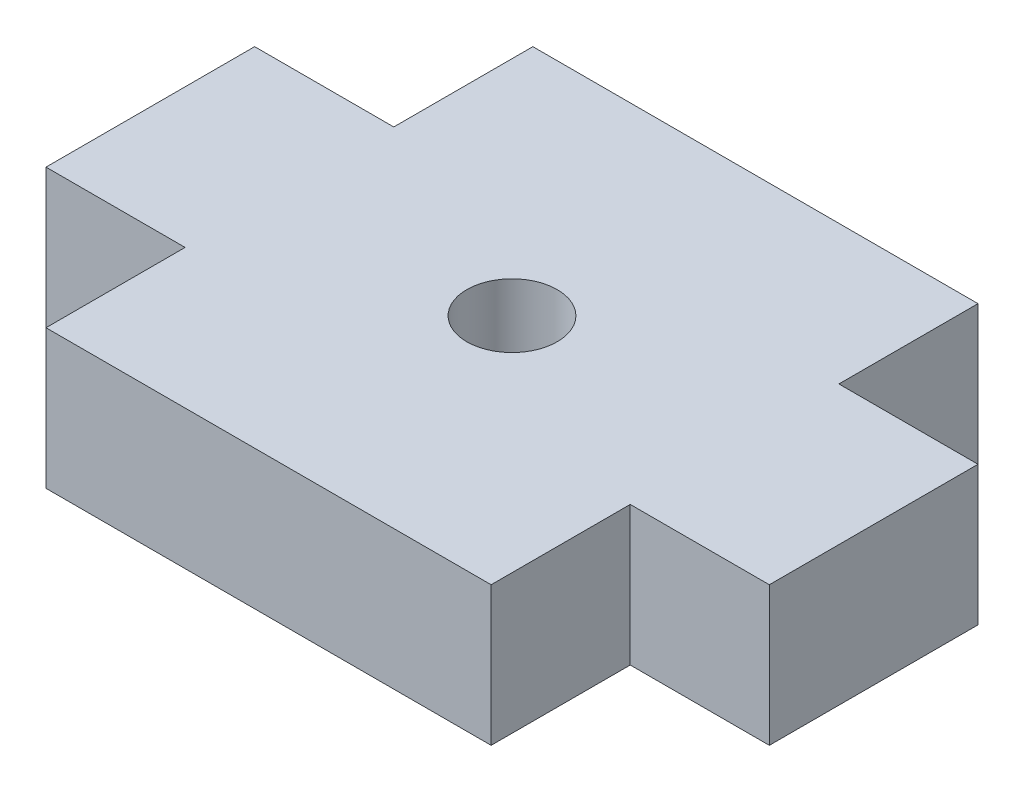
ISO-10303-21;
HEADER;
FILE_DESCRIPTION(('STEP AP214'),'2;1');
FILE_NAME('part.step','',(''),(''),'','','');
FILE_SCHEMA(('AUTOMOTIVE_DESIGN { 1 0 10303 214 1 1 1 1 }'));
ENDSEC;
DATA;
#1=APPLICATION_CONTEXT('core data for automotive mechanical design processes');
#2=APPLICATION_PROTOCOL_DEFINITION('international standard','automotive_design',2000,#1);
#3=PRODUCT_CONTEXT('',#1,'mechanical');
#4=PRODUCT('Part','Part','',(#3));
#5=PRODUCT_RELATED_PRODUCT_CATEGORY('part','',(#4));
#6=PRODUCT_DEFINITION_FORMATION('','',#4);
#7=PRODUCT_DEFINITION_CONTEXT('part definition',#1,'design');
#8=PRODUCT_DEFINITION('design','',#6,#7);
#9=PRODUCT_DEFINITION_SHAPE('','',#8);
#10=(LENGTH_UNIT() NAMED_UNIT(*) SI_UNIT(.MILLI.,.METRE.));
#11=(NAMED_UNIT(*) PLANE_ANGLE_UNIT() SI_UNIT($,.RADIAN.));
#12=(NAMED_UNIT(*) SI_UNIT($,.STERADIAN.) SOLID_ANGLE_UNIT());
#13=UNCERTAINTY_MEASURE_WITH_UNIT(LENGTH_MEASURE(1.E-05),#10,'distance_accuracy_value','');
#14=(GEOMETRIC_REPRESENTATION_CONTEXT(3) GLOBAL_UNCERTAINTY_ASSIGNED_CONTEXT((#13)) GLOBAL_UNIT_ASSIGNED_CONTEXT((#10,
#11,#12)) REPRESENTATION_CONTEXT('',''));
#15=CARTESIAN_POINT('',(0.,0.,0.));
#16=DIRECTION('',(0.,0.,1.));
#17=DIRECTION('',(1.,0.,0.));
#18=AXIS2_PLACEMENT_3D('',#15,#16,#17);
#19=CARTESIAN_POINT('',(8.,5.,-3.75));
#20=DIRECTION('',(0.,1.,0.));
#21=DIRECTION('',(0.,0.,1.));
#22=AXIS2_PLACEMENT_3D('',#19,#20,#21);
#23=PLANE('',#22);
#24=DIRECTION('',(0.,0.,-1.));
#25=VECTOR('',#24,1.);
#26=CARTESIAN_POINT('',(8.,5.,-8.75));
#27=LINE('',#26,#25);
#28=CARTESIAN_POINT('',(8.,5.,-3.75));
#29=VERTEX_POINT('',#28);
#30=CARTESIAN_POINT('',(8.,5.,-8.75));
#31=VERTEX_POINT('',#30);
#32=EDGE_CURVE('E174',#29,#31,#27,.T.);
#33=ORIENTED_EDGE('',*,*,#32,.T.);
#34=DIRECTION('',(-1.,0.,0.));
#35=VECTOR('',#34,1.);
#36=CARTESIAN_POINT('',(-8.,5.,-8.75));
#37=LINE('',#36,#35);
#38=CARTESIAN_POINT('',(-8.,5.,-8.75));
#39=VERTEX_POINT('',#38);
#40=EDGE_CURVE('E102',#31,#39,#37,.T.);
#41=ORIENTED_EDGE('',*,*,#40,.T.);
#42=DIRECTION('',(0.,0.,1.));
#43=VECTOR('',#42,1.);
#44=CARTESIAN_POINT('',(-8.,5.,-8.75));
#45=LINE('',#44,#43);
#46=CARTESIAN_POINT('',(-8.,5.,-3.75));
#47=VERTEX_POINT('',#46);
#48=EDGE_CURVE('E201',#39,#47,#45,.T.);
#49=ORIENTED_EDGE('',*,*,#48,.T.);
#50=DIRECTION('',(-1.,0.,0.));
#51=VECTOR('',#50,1.);
#52=CARTESIAN_POINT('',(-8.,5.,-3.75));
#53=LINE('',#52,#51);
#54=CARTESIAN_POINT('',(-13.,5.,-3.75));
#55=VERTEX_POINT('',#54);
#56=EDGE_CURVE('E220',#47,#55,#53,.T.);
#57=ORIENTED_EDGE('',*,*,#56,.T.);
#58=DIRECTION('',(0.,0.,1.));
#59=VECTOR('',#58,1.);
#60=CARTESIAN_POINT('',(-13.,5.,-3.75));
#61=LINE('',#60,#59);
#62=CARTESIAN_POINT('',(-13.,5.,3.75));
#63=VERTEX_POINT('',#62);
#64=EDGE_CURVE('E217',#55,#63,#61,.T.);
#65=ORIENTED_EDGE('',*,*,#64,.T.);
#66=DIRECTION('',(1.,0.,0.));
#67=VECTOR('',#66,1.);
#68=CARTESIAN_POINT('',(-8.,5.,3.75));
#69=LINE('',#68,#67);
#70=CARTESIAN_POINT('',(-8.,5.,3.75));
#71=VERTEX_POINT('',#70);
#72=EDGE_CURVE('E219',#63,#71,#69,.T.);
#73=ORIENTED_EDGE('',*,*,#72,.T.);
#74=DIRECTION('',(0.,0.,1.));
#75=VECTOR('',#74,1.);
#76=CARTESIAN_POINT('',(-8.,5.,8.75));
#77=LINE('',#76,#75);
#78=CARTESIAN_POINT('',(-8.,5.,8.75));
#79=VERTEX_POINT('',#78);
#80=EDGE_CURVE('E222',#71,#79,#77,.T.);
#81=ORIENTED_EDGE('',*,*,#80,.T.);
#82=DIRECTION('',(1.,0.,0.));
#83=VECTOR('',#82,1.);
#84=CARTESIAN_POINT('',(-8.,5.,8.75));
#85=LINE('',#84,#83);
#86=CARTESIAN_POINT('',(8.,5.,8.75));
#87=VERTEX_POINT('',#86);
#88=EDGE_CURVE('E228',#79,#87,#85,.T.);
#89=ORIENTED_EDGE('',*,*,#88,.T.);
#90=DIRECTION('',(0.,0.,-1.));
#91=VECTOR('',#90,1.);
#92=CARTESIAN_POINT('',(8.,5.,8.75));
#93=LINE('',#92,#91);
#94=CARTESIAN_POINT('',(8.,5.,3.75));
#95=VERTEX_POINT('',#94);
#96=EDGE_CURVE('E133',#87,#95,#93,.T.);
#97=ORIENTED_EDGE('',*,*,#96,.T.);
#98=DIRECTION('',(1.,0.,0.));
#99=VECTOR('',#98,1.);
#100=CARTESIAN_POINT('',(8.,5.,3.75));
#101=LINE('',#100,#99);
#102=CARTESIAN_POINT('',(13.,5.,3.75));
#103=VERTEX_POINT('',#102);
#104=EDGE_CURVE('E127',#95,#103,#101,.T.);
#105=ORIENTED_EDGE('',*,*,#104,.T.);
#106=DIRECTION('',(0.,0.,-1.));
#107=VECTOR('',#106,1.);
#108=CARTESIAN_POINT('',(13.,5.,-3.75));
#109=LINE('',#108,#107);
#110=CARTESIAN_POINT('',(13.,5.,-3.75));
#111=VERTEX_POINT('',#110);
#112=EDGE_CURVE('E131',#103,#111,#109,.T.);
#113=ORIENTED_EDGE('',*,*,#112,.T.);
#114=DIRECTION('',(-1.,0.,0.));
#115=VECTOR('',#114,1.);
#116=CARTESIAN_POINT('',(8.,5.,-3.75));
#117=LINE('',#116,#115);
#118=EDGE_CURVE('E47',#111,#29,#117,.T.);
#119=ORIENTED_EDGE('',*,*,#118,.T.);
#120=EDGE_LOOP('',(#33,#41,#49,#57,#65,#73,#81,#89,#97,#105,#113,#119));
#121=FACE_BOUND('',#120,.T.);
#122=CARTESIAN_POINT('',(0.,5.,0.));
#123=DIRECTION('',(0.,1.,0.));
#124=DIRECTION('',(0.,0.,1.));
#125=AXIS2_PLACEMENT_3D('',#122,#123,#124);
#126=CIRCLE('',#125,1.625);
#127=CARTESIAN_POINT('',(0.,5.,1.625));
#128=VERTEX_POINT('',#127);
#129=EDGE_CURVE('E155',#128,#128,#126,.T.);
#130=ORIENTED_EDGE('',*,*,#129,.F.);
#131=EDGE_LOOP('',(#130));
#132=FACE_BOUND('',#131,.T.);
#133=ADVANCED_FACE('F30',(#121,#132),#23,.T.);
#134=CARTESIAN_POINT('',(8.,0.,-3.75));
#135=DIRECTION('',(0.,1.,0.));
#136=DIRECTION('',(0.,0.,1.));
#137=AXIS2_PLACEMENT_3D('',#134,#135,#136);
#138=PLANE('',#137);
#139=DIRECTION('',(0.,0.,-1.));
#140=VECTOR('',#139,1.);
#141=CARTESIAN_POINT('',(8.,0.,-8.75));
#142=LINE('',#141,#140);
#143=CARTESIAN_POINT('',(8.,0.,-3.75));
#144=VERTEX_POINT('',#143);
#145=CARTESIAN_POINT('',(8.,0.,-8.75));
#146=VERTEX_POINT('',#145);
#147=EDGE_CURVE('E151',#144,#146,#142,.T.);
#148=ORIENTED_EDGE('',*,*,#147,.F.);
#149=DIRECTION('',(-1.,0.,0.));
#150=VECTOR('',#149,1.);
#151=CARTESIAN_POINT('',(8.,0.,-3.75));
#152=LINE('',#151,#150);
#153=CARTESIAN_POINT('',(13.,0.,-3.75));
#154=VERTEX_POINT('',#153);
#155=EDGE_CURVE('E94',#154,#144,#152,.T.);
#156=ORIENTED_EDGE('',*,*,#155,.F.);
#157=DIRECTION('',(0.,0.,-1.));
#158=VECTOR('',#157,1.);
#159=CARTESIAN_POINT('',(13.,0.,-3.75));
#160=LINE('',#159,#158);
#161=CARTESIAN_POINT('',(13.,0.,3.75));
#162=VERTEX_POINT('',#161);
#163=EDGE_CURVE('E88',#162,#154,#160,.T.);
#164=ORIENTED_EDGE('',*,*,#163,.F.);
#165=DIRECTION('',(1.,0.,0.));
#166=VECTOR('',#165,1.);
#167=CARTESIAN_POINT('',(8.,0.,3.75));
#168=LINE('',#167,#166);
#169=CARTESIAN_POINT('',(8.,0.,3.75));
#170=VERTEX_POINT('',#169);
#171=EDGE_CURVE('E141',#170,#162,#168,.T.);
#172=ORIENTED_EDGE('',*,*,#171,.F.);
#173=DIRECTION('',(0.,0.,-1.));
#174=VECTOR('',#173,1.);
#175=CARTESIAN_POINT('',(8.,0.,8.75));
#176=LINE('',#175,#174);
#177=CARTESIAN_POINT('',(8.,0.,8.75));
#178=VERTEX_POINT('',#177);
#179=EDGE_CURVE('E169',#178,#170,#176,.T.);
#180=ORIENTED_EDGE('',*,*,#179,.F.);
#181=DIRECTION('',(1.,0.,0.));
#182=VECTOR('',#181,1.);
#183=CARTESIAN_POINT('',(-8.,0.,8.75));
#184=LINE('',#183,#182);
#185=CARTESIAN_POINT('',(-8.,0.,8.75));
#186=VERTEX_POINT('',#185);
#187=EDGE_CURVE('E167',#186,#178,#184,.T.);
#188=ORIENTED_EDGE('',*,*,#187,.F.);
#189=DIRECTION('',(0.,0.,1.));
#190=VECTOR('',#189,1.);
#191=CARTESIAN_POINT('',(-8.,0.,8.75));
#192=LINE('',#191,#190);
#193=CARTESIAN_POINT('',(-8.,0.,3.75));
#194=VERTEX_POINT('',#193);
#195=EDGE_CURVE('E165',#194,#186,#192,.T.);
#196=ORIENTED_EDGE('',*,*,#195,.F.);
#197=DIRECTION('',(1.,0.,0.));
#198=VECTOR('',#197,1.);
#199=CARTESIAN_POINT('',(-8.,0.,3.75));
#200=LINE('',#199,#198);
#201=CARTESIAN_POINT('',(-13.,0.,3.75));
#202=VERTEX_POINT('',#201);
#203=EDGE_CURVE('E163',#202,#194,#200,.T.);
#204=ORIENTED_EDGE('',*,*,#203,.F.);
#205=DIRECTION('',(0.,0.,1.));
#206=VECTOR('',#205,1.);
#207=CARTESIAN_POINT('',(-13.,0.,-3.75));
#208=LINE('',#207,#206);
#209=CARTESIAN_POINT('',(-13.,0.,-3.75));
#210=VERTEX_POINT('',#209);
#211=EDGE_CURVE('E161',#210,#202,#208,.T.);
#212=ORIENTED_EDGE('',*,*,#211,.F.);
#213=DIRECTION('',(-1.,0.,0.));
#214=VECTOR('',#213,1.);
#215=CARTESIAN_POINT('',(-8.,0.,-3.75));
#216=LINE('',#215,#214);
#217=CARTESIAN_POINT('',(-8.,0.,-3.75));
#218=VERTEX_POINT('',#217);
#219=EDGE_CURVE('E159',#218,#210,#216,.T.);
#220=ORIENTED_EDGE('',*,*,#219,.F.);
#221=DIRECTION('',(0.,0.,1.));
#222=VECTOR('',#221,1.);
#223=CARTESIAN_POINT('',(-8.,0.,-8.75));
#224=LINE('',#223,#222);
#225=CARTESIAN_POINT('',(-8.,0.,-8.75));
#226=VERTEX_POINT('',#225);
#227=EDGE_CURVE('E157',#226,#218,#224,.T.);
#228=ORIENTED_EDGE('',*,*,#227,.F.);
#229=DIRECTION('',(-1.,0.,0.));
#230=VECTOR('',#229,1.);
#231=CARTESIAN_POINT('',(-8.,0.,-8.75));
#232=LINE('',#231,#230);
#233=EDGE_CURVE('E154',#146,#226,#232,.T.);
#234=ORIENTED_EDGE('',*,*,#233,.F.);
#235=EDGE_LOOP('',(#148,#156,#164,#172,#180,#188,#196,#204,#212,#220,#228,#234));
#236=FACE_BOUND('',#235,.T.);
#237=CARTESIAN_POINT('',(0.,0.,0.));
#238=DIRECTION('',(0.,1.,0.));
#239=DIRECTION('',(0.,0.,1.));
#240=AXIS2_PLACEMENT_3D('',#237,#238,#239);
#241=CIRCLE('',#240,1.625);
#242=CARTESIAN_POINT('',(0.,0.,1.625));
#243=VERTEX_POINT('',#242);
#244=EDGE_CURVE('E375',#243,#243,#241,.T.);
#245=ORIENTED_EDGE('',*,*,#244,.T.);
#246=EDGE_LOOP('',(#245));
#247=FACE_BOUND('',#246,.T.);
#248=ADVANCED_FACE('F205',(#236,#247),#138,.F.);
#249=CARTESIAN_POINT('',(8.,5.,-8.75));
#250=DIRECTION('',(-1.,0.,0.));
#251=DIRECTION('',(0.,0.,1.));
#252=AXIS2_PLACEMENT_3D('',#249,#250,#251);
#253=PLANE('',#252);
#254=ORIENTED_EDGE('',*,*,#147,.T.);
#255=DIRECTION('',(0.,-1.,0.));
#256=VECTOR('',#255,1.);
#257=CARTESIAN_POINT('',(8.,5.,-8.75));
#258=LINE('',#257,#256);
#259=EDGE_CURVE('E11',#31,#146,#258,.T.);
#260=ORIENTED_EDGE('',*,*,#259,.F.);
#261=ORIENTED_EDGE('',*,*,#32,.F.);
#262=DIRECTION('',(0.,-1.,0.));
#263=VECTOR('',#262,1.);
#264=CARTESIAN_POINT('',(8.,5.,-3.75));
#265=LINE('',#264,#263);
#266=EDGE_CURVE('E147',#29,#144,#265,.T.);
#267=ORIENTED_EDGE('',*,*,#266,.T.);
#268=EDGE_LOOP('',(#254,#260,#261,#267));
#269=FACE_BOUND('',#268,.T.);
#270=ADVANCED_FACE('F32',(#269),#253,.F.);
#271=CARTESIAN_POINT('',(-8.,5.,-8.75));
#272=DIRECTION('',(0.,0.,1.));
#273=DIRECTION('',(1.,0.,0.));
#274=AXIS2_PLACEMENT_3D('',#271,#272,#273);
#275=PLANE('',#274);
#276=ORIENTED_EDGE('',*,*,#233,.T.);
#277=DIRECTION('',(0.,-1.,0.));
#278=VECTOR('',#277,1.);
#279=CARTESIAN_POINT('',(-8.,5.,-8.75));
#280=LINE('',#279,#278);
#281=EDGE_CURVE('E39',#39,#226,#280,.T.);
#282=ORIENTED_EDGE('',*,*,#281,.F.);
#283=ORIENTED_EDGE('',*,*,#40,.F.);
#284=ORIENTED_EDGE('',*,*,#259,.T.);
#285=EDGE_LOOP('',(#276,#282,#283,#284));
#286=FACE_BOUND('',#285,.T.);
#287=ADVANCED_FACE('F262',(#286),#275,.F.);
#288=CARTESIAN_POINT('',(-8.,5.,-8.75));
#289=DIRECTION('',(1.,0.,0.));
#290=DIRECTION('',(0.,0.,-1.));
#291=AXIS2_PLACEMENT_3D('',#288,#289,#290);
#292=PLANE('',#291);
#293=ORIENTED_EDGE('',*,*,#227,.T.);
#294=DIRECTION('',(0.,-1.,0.));
#295=VECTOR('',#294,1.);
#296=CARTESIAN_POINT('',(-8.,5.,-3.75));
#297=LINE('',#296,#295);
#298=EDGE_CURVE('E193',#47,#218,#297,.T.);
#299=ORIENTED_EDGE('',*,*,#298,.F.);
#300=ORIENTED_EDGE('',*,*,#48,.F.);
#301=ORIENTED_EDGE('',*,*,#281,.T.);
#302=EDGE_LOOP('',(#293,#299,#300,#301));
#303=FACE_BOUND('',#302,.T.);
#304=ADVANCED_FACE('F199',(#303),#292,.F.);
#305=CARTESIAN_POINT('',(-8.,5.,-3.75));
#306=DIRECTION('',(0.,0.,1.));
#307=DIRECTION('',(1.,0.,0.));
#308=AXIS2_PLACEMENT_3D('',#305,#306,#307);
#309=PLANE('',#308);
#310=ORIENTED_EDGE('',*,*,#219,.T.);
#311=DIRECTION('',(0.,-1.,0.));
#312=VECTOR('',#311,1.);
#313=CARTESIAN_POINT('',(-13.,5.,-3.75));
#314=LINE('',#313,#312);
#315=EDGE_CURVE('E190',#55,#210,#314,.T.);
#316=ORIENTED_EDGE('',*,*,#315,.F.);
#317=ORIENTED_EDGE('',*,*,#56,.F.);
#318=ORIENTED_EDGE('',*,*,#298,.T.);
#319=EDGE_LOOP('',(#310,#316,#317,#318));
#320=FACE_BOUND('',#319,.T.);
#321=ADVANCED_FACE('F211',(#320),#309,.F.);
#322=CARTESIAN_POINT('',(-13.,5.,-3.75));
#323=DIRECTION('',(1.,0.,0.));
#324=DIRECTION('',(0.,0.,-1.));
#325=AXIS2_PLACEMENT_3D('',#322,#323,#324);
#326=PLANE('',#325);
#327=ORIENTED_EDGE('',*,*,#211,.T.);
#328=DIRECTION('',(0.,-1.,0.));
#329=VECTOR('',#328,1.);
#330=CARTESIAN_POINT('',(-13.,5.,3.75));
#331=LINE('',#330,#329);
#332=EDGE_CURVE('E187',#63,#202,#331,.T.);
#333=ORIENTED_EDGE('',*,*,#332,.F.);
#334=ORIENTED_EDGE('',*,*,#64,.F.);
#335=ORIENTED_EDGE('',*,*,#315,.T.);
#336=EDGE_LOOP('',(#327,#333,#334,#335));
#337=FACE_BOUND('',#336,.T.);
#338=ADVANCED_FACE('F215',(#337),#326,.F.);
#339=CARTESIAN_POINT('',(-8.,5.,3.75));
#340=DIRECTION('',(0.,0.,-1.));
#341=DIRECTION('',(-1.,0.,0.));
#342=AXIS2_PLACEMENT_3D('',#339,#340,#341);
#343=PLANE('',#342);
#344=ORIENTED_EDGE('',*,*,#203,.T.);
#345=DIRECTION('',(0.,-1.,0.));
#346=VECTOR('',#345,1.);
#347=CARTESIAN_POINT('',(-8.,5.,3.75));
#348=LINE('',#347,#346);
#349=EDGE_CURVE('E184',#71,#194,#348,.T.);
#350=ORIENTED_EDGE('',*,*,#349,.F.);
#351=ORIENTED_EDGE('',*,*,#72,.F.);
#352=ORIENTED_EDGE('',*,*,#332,.T.);
#353=EDGE_LOOP('',(#344,#350,#351,#352));
#354=FACE_BOUND('',#353,.T.);
#355=ADVANCED_FACE('F275',(#354),#343,.F.);
#356=CARTESIAN_POINT('',(-8.,5.,8.75));
#357=DIRECTION('',(1.,0.,0.));
#358=DIRECTION('',(0.,0.,-1.));
#359=AXIS2_PLACEMENT_3D('',#356,#357,#358);
#360=PLANE('',#359);
#361=ORIENTED_EDGE('',*,*,#195,.T.);
#362=DIRECTION('',(0.,-1.,0.));
#363=VECTOR('',#362,1.);
#364=CARTESIAN_POINT('',(-8.,5.,8.75));
#365=LINE('',#364,#363);
#366=EDGE_CURVE('E181',#79,#186,#365,.T.);
#367=ORIENTED_EDGE('',*,*,#366,.F.);
#368=ORIENTED_EDGE('',*,*,#80,.F.);
#369=ORIENTED_EDGE('',*,*,#349,.T.);
#370=EDGE_LOOP('',(#361,#367,#368,#369));
#371=FACE_BOUND('',#370,.T.);
#372=ADVANCED_FACE('F278',(#371),#360,.F.);
#373=CARTESIAN_POINT('',(-8.,5.,8.75));
#374=DIRECTION('',(0.,0.,-1.));
#375=DIRECTION('',(-1.,0.,0.));
#376=AXIS2_PLACEMENT_3D('',#373,#374,#375);
#377=PLANE('',#376);
#378=ORIENTED_EDGE('',*,*,#187,.T.);
#379=DIRECTION('',(0.,-1.,0.));
#380=VECTOR('',#379,1.);
#381=CARTESIAN_POINT('',(8.,5.,8.75));
#382=LINE('',#381,#380);
#383=EDGE_CURVE('E178',#87,#178,#382,.T.);
#384=ORIENTED_EDGE('',*,*,#383,.F.);
#385=ORIENTED_EDGE('',*,*,#88,.F.);
#386=ORIENTED_EDGE('',*,*,#366,.T.);
#387=EDGE_LOOP('',(#378,#384,#385,#386));
#388=FACE_BOUND('',#387,.T.);
#389=ADVANCED_FACE('F234',(#388),#377,.F.);
#390=CARTESIAN_POINT('',(8.,5.,8.75));
#391=DIRECTION('',(-1.,0.,0.));
#392=DIRECTION('',(0.,0.,1.));
#393=AXIS2_PLACEMENT_3D('',#390,#391,#392);
#394=PLANE('',#393);
#395=ORIENTED_EDGE('',*,*,#179,.T.);
#396=DIRECTION('',(0.,-1.,0.));
#397=VECTOR('',#396,1.);
#398=CARTESIAN_POINT('',(8.,5.,3.75));
#399=LINE('',#398,#397);
#400=EDGE_CURVE('E142',#95,#170,#399,.T.);
#401=ORIENTED_EDGE('',*,*,#400,.F.);
#402=ORIENTED_EDGE('',*,*,#96,.F.);
#403=ORIENTED_EDGE('',*,*,#383,.T.);
#404=EDGE_LOOP('',(#395,#401,#402,#403));
#405=FACE_BOUND('',#404,.T.);
#406=ADVANCED_FACE('F238',(#405),#394,.F.);
#407=CARTESIAN_POINT('',(8.,5.,3.75));
#408=DIRECTION('',(0.,0.,-1.));
#409=DIRECTION('',(-1.,0.,0.));
#410=AXIS2_PLACEMENT_3D('',#407,#408,#409);
#411=PLANE('',#410);
#412=ORIENTED_EDGE('',*,*,#171,.T.);
#413=DIRECTION('',(0.,-1.,0.));
#414=VECTOR('',#413,1.);
#415=CARTESIAN_POINT('',(13.,5.,3.75));
#416=LINE('',#415,#414);
#417=EDGE_CURVE('E138',#103,#162,#416,.T.);
#418=ORIENTED_EDGE('',*,*,#417,.F.);
#419=ORIENTED_EDGE('',*,*,#104,.F.);
#420=ORIENTED_EDGE('',*,*,#400,.T.);
#421=EDGE_LOOP('',(#412,#418,#419,#420));
#422=FACE_BOUND('',#421,.T.);
#423=ADVANCED_FACE('F139',(#422),#411,.F.);
#424=CARTESIAN_POINT('',(13.,5.,-3.75));
#425=DIRECTION('',(-1.,0.,0.));
#426=DIRECTION('',(0.,0.,1.));
#427=AXIS2_PLACEMENT_3D('',#424,#425,#426);
#428=PLANE('',#427);
#429=ORIENTED_EDGE('',*,*,#163,.T.);
#430=DIRECTION('',(0.,-1.,0.));
#431=VECTOR('',#430,1.);
#432=CARTESIAN_POINT('',(13.,5.,-3.75));
#433=LINE('',#432,#431);
#434=EDGE_CURVE('E143',#111,#154,#433,.T.);
#435=ORIENTED_EDGE('',*,*,#434,.F.);
#436=ORIENTED_EDGE('',*,*,#112,.F.);
#437=ORIENTED_EDGE('',*,*,#417,.T.);
#438=EDGE_LOOP('',(#429,#435,#436,#437));
#439=FACE_BOUND('',#438,.T.);
#440=ADVANCED_FACE('F145',(#439),#428,.F.);
#441=CARTESIAN_POINT('',(8.,5.,-3.75));
#442=DIRECTION('',(0.,0.,1.));
#443=DIRECTION('',(1.,0.,0.));
#444=AXIS2_PLACEMENT_3D('',#441,#442,#443);
#445=PLANE('',#444);
#446=ORIENTED_EDGE('',*,*,#155,.T.);
#447=ORIENTED_EDGE('',*,*,#266,.F.);
#448=ORIENTED_EDGE('',*,*,#118,.F.);
#449=ORIENTED_EDGE('',*,*,#434,.T.);
#450=EDGE_LOOP('',(#446,#447,#448,#449));
#451=FACE_BOUND('',#450,.T.);
#452=ADVANCED_FACE('F242',(#451),#445,.F.);
#453=CARTESIAN_POINT('',(0.,5.,0.));
#454=DIRECTION('',(0.,-1.,0.));
#455=DIRECTION('',(0.,0.,-1.));
#456=AXIS2_PLACEMENT_3D('',#453,#454,#455);
#457=CYLINDRICAL_SURFACE('',#456,1.625);
#458=ORIENTED_EDGE('',*,*,#129,.T.);
#459=EDGE_LOOP('',(#458));
#460=FACE_BOUND('',#459,.T.);
#461=ORIENTED_EDGE('',*,*,#244,.F.);
#462=EDGE_LOOP('',(#461));
#463=FACE_BOUND('',#462,.T.);
#464=ADVANCED_FACE('F244',(#460,#463),#457,.F.);
#465=CLOSED_SHELL('',(#133,#248,#270,#287,#304,#321,#338,#355,#372,#389,#406,#423,#440,#452,#464));
#466=MANIFOLD_SOLID_BREP('B2',#465);
#467=ADVANCED_BREP_SHAPE_REPRESENTATION('',(#18,#466),#14);
#468=SHAPE_DEFINITION_REPRESENTATION(#9,#467);
ENDSEC;
END-ISO-10303-21;
